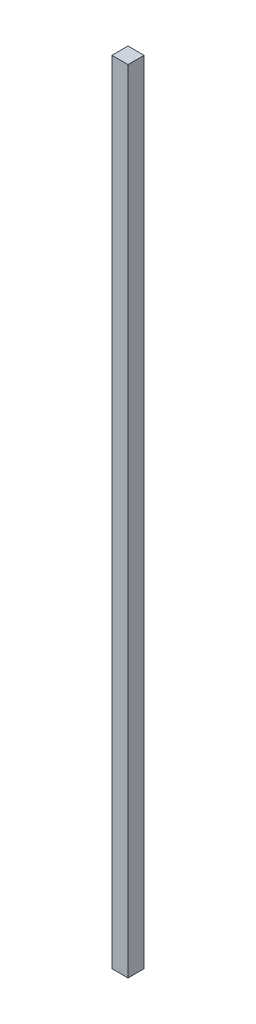
ISO-10303-21;
HEADER;
FILE_DESCRIPTION(('STEP AP214'),'2;1');
FILE_NAME('part.step','',(''),(''),'','','');
FILE_SCHEMA(('AUTOMOTIVE_DESIGN { 1 0 10303 214 1 1 1 1 }'));
ENDSEC;
DATA;
#1=APPLICATION_CONTEXT('core data for automotive mechanical design processes');
#2=APPLICATION_PROTOCOL_DEFINITION('international standard','automotive_design',2000,#1);
#3=PRODUCT_CONTEXT('',#1,'mechanical');
#4=PRODUCT('Part','Part','',(#3));
#5=PRODUCT_RELATED_PRODUCT_CATEGORY('part','',(#4));
#6=PRODUCT_DEFINITION_FORMATION('','',#4);
#7=PRODUCT_DEFINITION_CONTEXT('part definition',#1,'design');
#8=PRODUCT_DEFINITION('design','',#6,#7);
#9=PRODUCT_DEFINITION_SHAPE('','',#8);
#10=(LENGTH_UNIT() NAMED_UNIT(*) SI_UNIT(.MILLI.,.METRE.));
#11=(NAMED_UNIT(*) PLANE_ANGLE_UNIT() SI_UNIT($,.RADIAN.));
#12=(NAMED_UNIT(*) SI_UNIT($,.STERADIAN.) SOLID_ANGLE_UNIT());
#13=UNCERTAINTY_MEASURE_WITH_UNIT(LENGTH_MEASURE(1.E-05),#10,'distance_accuracy_value','');
#14=(GEOMETRIC_REPRESENTATION_CONTEXT(3) GLOBAL_UNCERTAINTY_ASSIGNED_CONTEXT((#13)) GLOBAL_UNIT_ASSIGNED_CONTEXT((#10,
#11,#12)) REPRESENTATION_CONTEXT('',''));
#15=CARTESIAN_POINT('',(0.,0.,0.));
#16=DIRECTION('',(0.,0.,1.));
#17=DIRECTION('',(1.,0.,0.));
#18=AXIS2_PLACEMENT_3D('',#15,#16,#17);
#19=CARTESIAN_POINT('',(2.5,245.2,-2.5));
#20=DIRECTION('',(-1.,0.,0.));
#21=DIRECTION('',(0.,0.,1.));
#22=AXIS2_PLACEMENT_3D('',#19,#20,#21);
#23=PLANE('',#22);
#24=DIRECTION('',(0.,0.,-1.));
#25=VECTOR('',#24,1.);
#26=CARTESIAN_POINT('',(2.5,0.,-2.5));
#27=LINE('',#26,#25);
#28=CARTESIAN_POINT('',(2.5,0.,2.5));
#29=VERTEX_POINT('',#28);
#30=CARTESIAN_POINT('',(2.5,0.,-2.5));
#31=VERTEX_POINT('',#30);
#32=EDGE_CURVE('E98',#29,#31,#27,.T.);
#33=ORIENTED_EDGE('',*,*,#32,.T.);
#34=DIRECTION('',(0.,-1.,0.));
#35=VECTOR('',#34,1.);
#36=CARTESIAN_POINT('',(2.5,245.2,-2.5));
#37=LINE('',#36,#35);
#38=CARTESIAN_POINT('',(2.5,245.2,-2.5));
#39=VERTEX_POINT('',#38);
#40=EDGE_CURVE('E11',#39,#31,#37,.T.);
#41=ORIENTED_EDGE('',*,*,#40,.F.);
#42=DIRECTION('',(0.,0.,-1.));
#43=VECTOR('',#42,1.);
#44=CARTESIAN_POINT('',(2.5,245.2,-2.5));
#45=LINE('',#44,#43);
#46=CARTESIAN_POINT('',(2.5,245.2,2.5));
#47=VERTEX_POINT('',#46);
#48=EDGE_CURVE('E86',#47,#39,#45,.T.);
#49=ORIENTED_EDGE('',*,*,#48,.F.);
#50=DIRECTION('',(0.,-1.,0.));
#51=VECTOR('',#50,1.);
#52=CARTESIAN_POINT('',(2.5,245.2,2.5));
#53=LINE('',#52,#51);
#54=EDGE_CURVE('E94',#47,#29,#53,.T.);
#55=ORIENTED_EDGE('',*,*,#54,.T.);
#56=EDGE_LOOP('',(#33,#41,#49,#55));
#57=FACE_BOUND('',#56,.T.);
#58=ADVANCED_FACE('F35',(#57),#23,.F.);
#59=CARTESIAN_POINT('',(-2.5,245.2,-2.5));
#60=DIRECTION('',(0.,0.,1.));
#61=DIRECTION('',(1.,0.,0.));
#62=AXIS2_PLACEMENT_3D('',#59,#60,#61);
#63=PLANE('',#62);
#64=DIRECTION('',(-1.,0.,0.));
#65=VECTOR('',#64,1.);
#66=CARTESIAN_POINT('',(-2.5,0.,-2.5));
#67=LINE('',#66,#65);
#68=CARTESIAN_POINT('',(-2.5,0.,-2.5));
#69=VERTEX_POINT('',#68);
#70=EDGE_CURVE('E90',#31,#69,#67,.T.);
#71=ORIENTED_EDGE('',*,*,#70,.T.);
#72=DIRECTION('',(0.,-1.,0.));
#73=VECTOR('',#72,1.);
#74=CARTESIAN_POINT('',(-2.5,245.2,-2.5));
#75=LINE('',#74,#73);
#76=CARTESIAN_POINT('',(-2.5,245.2,-2.5));
#77=VERTEX_POINT('',#76);
#78=EDGE_CURVE('E43',#77,#69,#75,.T.);
#79=ORIENTED_EDGE('',*,*,#78,.F.);
#80=DIRECTION('',(-1.,0.,0.));
#81=VECTOR('',#80,1.);
#82=CARTESIAN_POINT('',(-2.5,245.2,-2.5));
#83=LINE('',#82,#81);
#84=EDGE_CURVE('E81',#39,#77,#83,.T.);
#85=ORIENTED_EDGE('',*,*,#84,.F.);
#86=ORIENTED_EDGE('',*,*,#40,.T.);
#87=EDGE_LOOP('',(#71,#79,#85,#86));
#88=FACE_BOUND('',#87,.T.);
#89=ADVANCED_FACE('F89',(#88),#63,.F.);
#90=CARTESIAN_POINT('',(-2.5,245.2,-2.5));
#91=DIRECTION('',(1.,0.,0.));
#92=DIRECTION('',(0.,0.,-1.));
#93=AXIS2_PLACEMENT_3D('',#90,#91,#92);
#94=PLANE('',#93);
#95=DIRECTION('',(0.,0.,1.));
#96=VECTOR('',#95,1.);
#97=CARTESIAN_POINT('',(-2.5,0.,-2.5));
#98=LINE('',#97,#96);
#99=CARTESIAN_POINT('',(-2.5,0.,2.5));
#100=VERTEX_POINT('',#99);
#101=EDGE_CURVE('E68',#69,#100,#98,.T.);
#102=ORIENTED_EDGE('',*,*,#101,.T.);
#103=DIRECTION('',(0.,-1.,0.));
#104=VECTOR('',#103,1.);
#105=CARTESIAN_POINT('',(-2.5,245.2,2.5));
#106=LINE('',#105,#104);
#107=CARTESIAN_POINT('',(-2.5,245.2,2.5));
#108=VERTEX_POINT('',#107);
#109=EDGE_CURVE('E91',#108,#100,#106,.T.);
#110=ORIENTED_EDGE('',*,*,#109,.F.);
#111=DIRECTION('',(0.,0.,1.));
#112=VECTOR('',#111,1.);
#113=CARTESIAN_POINT('',(-2.5,245.2,-2.5));
#114=LINE('',#113,#112);
#115=EDGE_CURVE('E84',#77,#108,#114,.T.);
#116=ORIENTED_EDGE('',*,*,#115,.F.);
#117=ORIENTED_EDGE('',*,*,#78,.T.);
#118=EDGE_LOOP('',(#102,#110,#116,#117));
#119=FACE_BOUND('',#118,.T.);
#120=ADVANCED_FACE('F92',(#119),#94,.F.);
#121=CARTESIAN_POINT('',(-2.5,245.2,2.5));
#122=DIRECTION('',(0.,0.,-1.));
#123=DIRECTION('',(-1.,0.,0.));
#124=AXIS2_PLACEMENT_3D('',#121,#122,#123);
#125=PLANE('',#124);
#126=DIRECTION('',(1.,0.,0.));
#127=VECTOR('',#126,1.);
#128=CARTESIAN_POINT('',(-2.5,0.,2.5));
#129=LINE('',#128,#127);
#130=EDGE_CURVE('E74',#100,#29,#129,.T.);
#131=ORIENTED_EDGE('',*,*,#130,.T.);
#132=ORIENTED_EDGE('',*,*,#54,.F.);
#133=DIRECTION('',(1.,0.,0.));
#134=VECTOR('',#133,1.);
#135=CARTESIAN_POINT('',(-2.5,245.2,2.5));
#136=LINE('',#135,#134);
#137=EDGE_CURVE('E51',#108,#47,#136,.T.);
#138=ORIENTED_EDGE('',*,*,#137,.F.);
#139=ORIENTED_EDGE('',*,*,#109,.T.);
#140=EDGE_LOOP('',(#131,#132,#138,#139));
#141=FACE_BOUND('',#140,.T.);
#142=ADVANCED_FACE('F105',(#141),#125,.F.);
#143=CARTESIAN_POINT('',(0.,245.2,0.));
#144=DIRECTION('',(0.,1.,0.));
#145=DIRECTION('',(0.,0.,1.));
#146=AXIS2_PLACEMENT_3D('',#143,#144,#145);
#147=PLANE('',#146);
#148=ORIENTED_EDGE('',*,*,#48,.T.);
#149=ORIENTED_EDGE('',*,*,#84,.T.);
#150=ORIENTED_EDGE('',*,*,#115,.T.);
#151=ORIENTED_EDGE('',*,*,#137,.T.);
#152=EDGE_LOOP('',(#148,#149,#150,#151));
#153=FACE_BOUND('',#152,.T.);
#154=ADVANCED_FACE('F82',(#153),#147,.T.);
#155=CARTESIAN_POINT('',(0.,0.,0.));
#156=DIRECTION('',(0.,1.,0.));
#157=DIRECTION('',(0.,0.,1.));
#158=AXIS2_PLACEMENT_3D('',#155,#156,#157);
#159=PLANE('',#158);
#160=ORIENTED_EDGE('',*,*,#32,.F.);
#161=ORIENTED_EDGE('',*,*,#130,.F.);
#162=ORIENTED_EDGE('',*,*,#101,.F.);
#163=ORIENTED_EDGE('',*,*,#70,.F.);
#164=EDGE_LOOP('',(#160,#161,#162,#163));
#165=FACE_BOUND('',#164,.T.);
#166=ADVANCED_FACE('F108',(#165),#159,.F.);
#167=CLOSED_SHELL('',(#58,#89,#120,#142,#154,#166));
#168=MANIFOLD_SOLID_BREP('B2',#167);
#169=ADVANCED_BREP_SHAPE_REPRESENTATION('',(#18,#168),#14);
#170=SHAPE_DEFINITION_REPRESENTATION(#9,#169);
ENDSEC;
END-ISO-10303-21;
